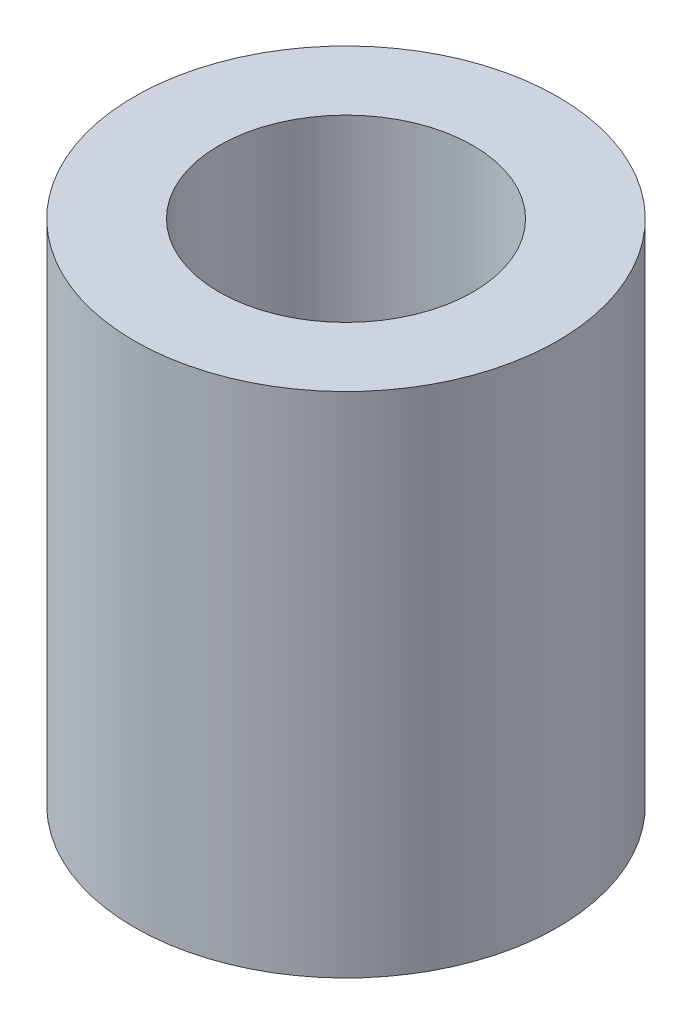
ISO-10303-21;
HEADER;
FILE_DESCRIPTION(('STEP AP214'),'2;1');
FILE_NAME('part.step','',(''),(''),'','','');
FILE_SCHEMA(('AUTOMOTIVE_DESIGN { 1 0 10303 214 1 1 1 1 }'));
ENDSEC;
DATA;
#1=APPLICATION_CONTEXT('core data for automotive mechanical design processes');
#2=APPLICATION_PROTOCOL_DEFINITION('international standard','automotive_design',2000,#1);
#3=PRODUCT_CONTEXT('',#1,'mechanical');
#4=PRODUCT('Part','Part','',(#3));
#5=PRODUCT_RELATED_PRODUCT_CATEGORY('part','',(#4));
#6=PRODUCT_DEFINITION_FORMATION('','',#4);
#7=PRODUCT_DEFINITION_CONTEXT('part definition',#1,'design');
#8=PRODUCT_DEFINITION('design','',#6,#7);
#9=PRODUCT_DEFINITION_SHAPE('','',#8);
#10=(LENGTH_UNIT() NAMED_UNIT(*) SI_UNIT(.MILLI.,.METRE.));
#11=(NAMED_UNIT(*) PLANE_ANGLE_UNIT() SI_UNIT($,.RADIAN.));
#12=(NAMED_UNIT(*) SI_UNIT($,.STERADIAN.) SOLID_ANGLE_UNIT());
#13=UNCERTAINTY_MEASURE_WITH_UNIT(LENGTH_MEASURE(1.E-05),#10,'distance_accuracy_value','');
#14=(GEOMETRIC_REPRESENTATION_CONTEXT(3) GLOBAL_UNCERTAINTY_ASSIGNED_CONTEXT((#13)) GLOBAL_UNIT_ASSIGNED_CONTEXT((#10,
#11,#12)) REPRESENTATION_CONTEXT('',''));
#15=CARTESIAN_POINT('',(0.,0.,0.));
#16=DIRECTION('',(0.,0.,1.));
#17=DIRECTION('',(1.,0.,0.));
#18=AXIS2_PLACEMENT_3D('',#15,#16,#17);
#19=CARTESIAN_POINT('',(0.,6.,0.));
#20=DIRECTION('',(0.,1.,0.));
#21=DIRECTION('',(0.,0.,1.));
#22=AXIS2_PLACEMENT_3D('',#19,#20,#21);
#23=PLANE('',#22);
#24=CARTESIAN_POINT('',(0.,6.,0.));
#25=DIRECTION('',(0.,1.,0.));
#26=DIRECTION('',(0.,0.,1.));
#27=AXIS2_PLACEMENT_3D('',#24,#25,#26);
#28=CIRCLE('',#27,2.5);
#29=CARTESIAN_POINT('',(0.,6.,2.5));
#30=VERTEX_POINT('',#29);
#31=EDGE_CURVE('E10',#30,#30,#28,.T.);
#32=ORIENTED_EDGE('',*,*,#31,.T.);
#33=EDGE_LOOP('',(#32));
#34=FACE_BOUND('',#33,.T.);
#35=CARTESIAN_POINT('',(0.,6.,0.));
#36=DIRECTION('',(0.,1.,0.));
#37=DIRECTION('',(0.,0.,1.));
#38=AXIS2_PLACEMENT_3D('',#35,#36,#37);
#39=CIRCLE('',#38,1.5);
#40=CARTESIAN_POINT('',(0.,6.,1.5));
#41=VERTEX_POINT('',#40);
#42=EDGE_CURVE('E50',#41,#41,#39,.T.);
#43=ORIENTED_EDGE('',*,*,#42,.F.);
#44=EDGE_LOOP('',(#43));
#45=FACE_BOUND('',#44,.T.);
#46=ADVANCED_FACE('F37',(#34,#45),#23,.T.);
#47=CARTESIAN_POINT('',(0.,0.,0.));
#48=DIRECTION('',(0.,1.,0.));
#49=DIRECTION('',(0.,0.,1.));
#50=AXIS2_PLACEMENT_3D('',#47,#48,#49);
#51=PLANE('',#50);
#52=CARTESIAN_POINT('',(0.,0.,0.));
#53=DIRECTION('',(0.,1.,0.));
#54=DIRECTION('',(0.,0.,1.));
#55=AXIS2_PLACEMENT_3D('',#52,#53,#54);
#56=CIRCLE('',#55,2.5);
#57=CARTESIAN_POINT('',(0.,0.,2.5));
#58=VERTEX_POINT('',#57);
#59=EDGE_CURVE('E41',#58,#58,#56,.T.);
#60=ORIENTED_EDGE('',*,*,#59,.F.);
#61=EDGE_LOOP('',(#60));
#62=FACE_BOUND('',#61,.T.);
#63=CARTESIAN_POINT('',(0.,0.,0.));
#64=DIRECTION('',(0.,1.,0.));
#65=DIRECTION('',(0.,0.,1.));
#66=AXIS2_PLACEMENT_3D('',#63,#64,#65);
#67=CIRCLE('',#66,1.5);
#68=CARTESIAN_POINT('',(0.,0.,1.5));
#69=VERTEX_POINT('',#68);
#70=EDGE_CURVE('E52',#69,#69,#67,.T.);
#71=ORIENTED_EDGE('',*,*,#70,.T.);
#72=EDGE_LOOP('',(#71));
#73=FACE_BOUND('',#72,.T.);
#74=ADVANCED_FACE('F64',(#62,#73),#51,.F.);
#75=CARTESIAN_POINT('',(0.,6.,0.));
#76=DIRECTION('',(0.,-1.,0.));
#77=DIRECTION('',(0.,0.,-1.));
#78=AXIS2_PLACEMENT_3D('',#75,#76,#77);
#79=CYLINDRICAL_SURFACE('',#78,2.5);
#80=ORIENTED_EDGE('',*,*,#31,.F.);
#81=EDGE_LOOP('',(#80));
#82=FACE_BOUND('',#81,.T.);
#83=ORIENTED_EDGE('',*,*,#59,.T.);
#84=EDGE_LOOP('',(#83));
#85=FACE_BOUND('',#84,.T.);
#86=ADVANCED_FACE('F39',(#82,#85),#79,.T.);
#87=CARTESIAN_POINT('',(0.,6.,0.));
#88=DIRECTION('',(0.,-1.,0.));
#89=DIRECTION('',(0.,0.,-1.));
#90=AXIS2_PLACEMENT_3D('',#87,#88,#89);
#91=CYLINDRICAL_SURFACE('',#90,1.5);
#92=ORIENTED_EDGE('',*,*,#42,.T.);
#93=EDGE_LOOP('',(#92));
#94=FACE_BOUND('',#93,.T.);
#95=ORIENTED_EDGE('',*,*,#70,.F.);
#96=EDGE_LOOP('',(#95));
#97=FACE_BOUND('',#96,.T.);
#98=ADVANCED_FACE('F60',(#94,#97),#91,.F.);
#99=CLOSED_SHELL('',(#46,#74,#86,#98));
#100=MANIFOLD_SOLID_BREP('B2',#99);
#101=ADVANCED_BREP_SHAPE_REPRESENTATION('',(#18,#100),#14);
#102=SHAPE_DEFINITION_REPRESENTATION(#9,#101);
ENDSEC;
END-ISO-10303-21;
